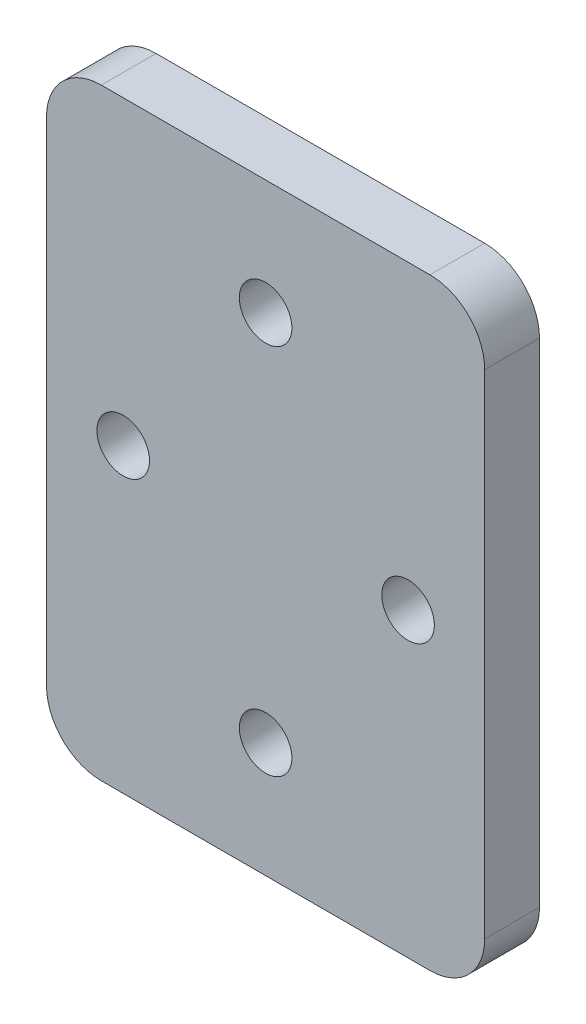
ISO-10303-21;
HEADER;
FILE_DESCRIPTION(('STEP AP214'),'2;1');
FILE_NAME('part.step','',(''),(''),'','','');
FILE_SCHEMA(('AUTOMOTIVE_DESIGN { 1 0 10303 214 1 1 1 1 }'));
ENDSEC;
DATA;
#1=APPLICATION_CONTEXT('core data for automotive mechanical design processes');
#2=APPLICATION_PROTOCOL_DEFINITION('international standard','automotive_design',2000,#1);
#3=PRODUCT_CONTEXT('',#1,'mechanical');
#4=PRODUCT('Part','Part','',(#3));
#5=PRODUCT_RELATED_PRODUCT_CATEGORY('part','',(#4));
#6=PRODUCT_DEFINITION_FORMATION('','',#4);
#7=PRODUCT_DEFINITION_CONTEXT('part definition',#1,'design');
#8=PRODUCT_DEFINITION('design','',#6,#7);
#9=PRODUCT_DEFINITION_SHAPE('','',#8);
#10=(LENGTH_UNIT() NAMED_UNIT(*) SI_UNIT(.MILLI.,.METRE.));
#11=(NAMED_UNIT(*) PLANE_ANGLE_UNIT() SI_UNIT($,.RADIAN.));
#12=(NAMED_UNIT(*) SI_UNIT($,.STERADIAN.) SOLID_ANGLE_UNIT());
#13=UNCERTAINTY_MEASURE_WITH_UNIT(LENGTH_MEASURE(1.E-05),#10,'distance_accuracy_value','');
#14=(GEOMETRIC_REPRESENTATION_CONTEXT(3) GLOBAL_UNCERTAINTY_ASSIGNED_CONTEXT((#13)) GLOBAL_UNIT_ASSIGNED_CONTEXT((#10,
#11,#12)) REPRESENTATION_CONTEXT('',''));
#15=CARTESIAN_POINT('',(0.,0.,0.));
#16=DIRECTION('',(0.,0.,1.));
#17=DIRECTION('',(1.,0.,0.));
#18=AXIS2_PLACEMENT_3D('',#15,#16,#17);
#19=CARTESIAN_POINT('',(0.,0.,5.));
#20=DIRECTION('',(0.,0.,1.));
#21=DIRECTION('',(1.,0.,0.));
#22=AXIS2_PLACEMENT_3D('',#19,#20,#21);
#23=PLANE('',#22);
#24=CARTESIAN_POINT('',(0.,-17.,5.));
#25=DIRECTION('',(0.,0.,1.));
#26=DIRECTION('',(-1.,0.,0.));
#27=AXIS2_PLACEMENT_3D('',#24,#25,#26);
#28=CIRCLE('',#27,2.4);
#29=CARTESIAN_POINT('',(-2.4,-17.,5.));
#30=VERTEX_POINT('',#29);
#31=EDGE_CURVE('E186',#30,#30,#28,.T.);
#32=ORIENTED_EDGE('',*,*,#31,.F.);
#33=EDGE_LOOP('',(#32));
#34=FACE_BOUND('',#33,.T.);
#35=CARTESIAN_POINT('',(0.,17.,5.));
#36=DIRECTION('',(0.,0.,1.));
#37=DIRECTION('',(1.,0.,0.));
#38=AXIS2_PLACEMENT_3D('',#35,#36,#37);
#39=CIRCLE('',#38,2.4);
#40=CARTESIAN_POINT('',(2.4,17.,5.));
#41=VERTEX_POINT('',#40);
#42=EDGE_CURVE('E132',#41,#41,#39,.T.);
#43=ORIENTED_EDGE('',*,*,#42,.F.);
#44=EDGE_LOOP('',(#43));
#45=FACE_BOUND('',#44,.T.);
#46=DIRECTION('',(0.,1.,0.));
#47=VECTOR('',#46,1.);
#48=CARTESIAN_POINT('',(20.,27.5,5.));
#49=LINE('',#48,#47);
#50=CARTESIAN_POINT('',(20.,-22.5,5.));
#51=VERTEX_POINT('',#50);
#52=CARTESIAN_POINT('',(20.,22.5,5.));
#53=VERTEX_POINT('',#52);
#54=EDGE_CURVE('E137',#51,#53,#49,.T.);
#55=ORIENTED_EDGE('',*,*,#54,.T.);
#56=CARTESIAN_POINT('',(15.,22.5,5.));
#57=DIRECTION('',(0.,0.,1.));
#58=DIRECTION('',(1.,0.,0.));
#59=AXIS2_PLACEMENT_3D('',#56,#57,#58);
#60=CIRCLE('',#59,5.);
#61=CARTESIAN_POINT('',(15.,27.5,5.));
#62=VERTEX_POINT('',#61);
#63=EDGE_CURVE('E152',#53,#62,#60,.T.);
#64=ORIENTED_EDGE('',*,*,#63,.T.);
#65=DIRECTION('',(-1.,0.,0.));
#66=VECTOR('',#65,1.);
#67=CARTESIAN_POINT('',(-20.,27.5,5.));
#68=LINE('',#67,#66);
#69=CARTESIAN_POINT('',(-15.,27.5,5.));
#70=VERTEX_POINT('',#69);
#71=EDGE_CURVE('E119',#62,#70,#68,.T.);
#72=ORIENTED_EDGE('',*,*,#71,.T.);
#73=CARTESIAN_POINT('',(-15.,22.5,5.));
#74=DIRECTION('',(0.,0.,1.));
#75=DIRECTION('',(1.,0.,0.));
#76=AXIS2_PLACEMENT_3D('',#73,#74,#75);
#77=CIRCLE('',#76,5.);
#78=CARTESIAN_POINT('',(-20.,22.5,5.));
#79=VERTEX_POINT('',#78);
#80=EDGE_CURVE('E147',#70,#79,#77,.T.);
#81=ORIENTED_EDGE('',*,*,#80,.T.);
#82=DIRECTION('',(0.,-1.,0.));
#83=VECTOR('',#82,1.);
#84=CARTESIAN_POINT('',(-20.,27.5,5.));
#85=LINE('',#84,#83);
#86=CARTESIAN_POINT('',(-20.,-22.5,5.));
#87=VERTEX_POINT('',#86);
#88=EDGE_CURVE('E163',#79,#87,#85,.T.);
#89=ORIENTED_EDGE('',*,*,#88,.T.);
#90=CARTESIAN_POINT('',(-15.,-22.5,5.));
#91=DIRECTION('',(0.,0.,1.));
#92=DIRECTION('',(1.,0.,0.));
#93=AXIS2_PLACEMENT_3D('',#90,#91,#92);
#94=CIRCLE('',#93,5.);
#95=CARTESIAN_POINT('',(-15.,-27.5,5.));
#96=VERTEX_POINT('',#95);
#97=EDGE_CURVE('E55',#87,#96,#94,.T.);
#98=ORIENTED_EDGE('',*,*,#97,.T.);
#99=DIRECTION('',(1.,0.,0.));
#100=VECTOR('',#99,1.);
#101=CARTESIAN_POINT('',(-20.,-27.5,5.));
#102=LINE('',#101,#100);
#103=CARTESIAN_POINT('',(15.,-27.5,5.));
#104=VERTEX_POINT('',#103);
#105=EDGE_CURVE('E138',#96,#104,#102,.T.);
#106=ORIENTED_EDGE('',*,*,#105,.T.);
#107=CARTESIAN_POINT('',(15.,-22.5,5.));
#108=DIRECTION('',(0.,0.,1.));
#109=DIRECTION('',(1.,0.,0.));
#110=AXIS2_PLACEMENT_3D('',#107,#108,#109);
#111=CIRCLE('',#110,5.);
#112=EDGE_CURVE('E150',#104,#51,#111,.T.);
#113=ORIENTED_EDGE('',*,*,#112,.T.);
#114=EDGE_LOOP('',(#55,#64,#72,#81,#89,#98,#106,#113));
#115=FACE_BOUND('',#114,.T.);
#116=CARTESIAN_POINT('',(-13.,0.,5.));
#117=DIRECTION('',(0.,0.,1.));
#118=DIRECTION('',(1.,0.,0.));
#119=AXIS2_PLACEMENT_3D('',#116,#117,#118);
#120=CIRCLE('',#119,2.4);
#121=CARTESIAN_POINT('',(-10.6,0.,5.));
#122=VERTEX_POINT('',#121);
#123=EDGE_CURVE('E180',#122,#122,#120,.T.);
#124=ORIENTED_EDGE('',*,*,#123,.F.);
#125=EDGE_LOOP('',(#124));
#126=FACE_BOUND('',#125,.T.);
#127=CARTESIAN_POINT('',(13.,0.,5.));
#128=DIRECTION('',(0.,0.,1.));
#129=DIRECTION('',(-1.,0.,0.));
#130=AXIS2_PLACEMENT_3D('',#127,#128,#129);
#131=CIRCLE('',#130,2.4);
#132=CARTESIAN_POINT('',(10.6,0.,5.));
#133=VERTEX_POINT('',#132);
#134=EDGE_CURVE('E192',#133,#133,#131,.T.);
#135=ORIENTED_EDGE('',*,*,#134,.F.);
#136=EDGE_LOOP('',(#135));
#137=FACE_BOUND('',#136,.T.);
#138=ADVANCED_FACE('F33',(#34,#45,#115,#126,#137),#23,.T.);
#139=CARTESIAN_POINT('',(0.,0.,0.));
#140=DIRECTION('',(0.,0.,1.));
#141=DIRECTION('',(1.,0.,0.));
#142=AXIS2_PLACEMENT_3D('',#139,#140,#141);
#143=PLANE('',#142);
#144=DIRECTION('',(-1.,0.,0.));
#145=VECTOR('',#144,1.);
#146=CARTESIAN_POINT('',(-20.,27.5,0.));
#147=LINE('',#146,#145);
#148=CARTESIAN_POINT('',(15.,27.5,0.));
#149=VERTEX_POINT('',#148);
#150=CARTESIAN_POINT('',(-15.,27.5,0.));
#151=VERTEX_POINT('',#150);
#152=EDGE_CURVE('E116',#149,#151,#147,.T.);
#153=ORIENTED_EDGE('',*,*,#152,.F.);
#154=CARTESIAN_POINT('',(15.,22.5,0.));
#155=DIRECTION('',(0.,0.,1.));
#156=DIRECTION('',(1.,0.,0.));
#157=AXIS2_PLACEMENT_3D('',#154,#155,#156);
#158=CIRCLE('',#157,5.);
#159=CARTESIAN_POINT('',(20.,22.5,0.));
#160=VERTEX_POINT('',#159);
#161=EDGE_CURVE('E99',#149,#160,#158,.F.);
#162=ORIENTED_EDGE('',*,*,#161,.T.);
#163=DIRECTION('',(0.,1.,0.));
#164=VECTOR('',#163,1.);
#165=CARTESIAN_POINT('',(20.,27.5,0.));
#166=LINE('',#165,#164);
#167=CARTESIAN_POINT('',(20.,-22.5,0.));
#168=VERTEX_POINT('',#167);
#169=EDGE_CURVE('E127',#168,#160,#166,.T.);
#170=ORIENTED_EDGE('',*,*,#169,.F.);
#171=CARTESIAN_POINT('',(15.,-22.5,0.));
#172=DIRECTION('',(0.,0.,1.));
#173=DIRECTION('',(1.,0.,0.));
#174=AXIS2_PLACEMENT_3D('',#171,#172,#173);
#175=CIRCLE('',#174,5.);
#176=CARTESIAN_POINT('',(15.,-27.5,0.));
#177=VERTEX_POINT('',#176);
#178=EDGE_CURVE('E110',#168,#177,#175,.F.);
#179=ORIENTED_EDGE('',*,*,#178,.T.);
#180=DIRECTION('',(1.,0.,0.));
#181=VECTOR('',#180,1.);
#182=CARTESIAN_POINT('',(-20.,-27.5,0.));
#183=LINE('',#182,#181);
#184=CARTESIAN_POINT('',(-15.,-27.5,0.));
#185=VERTEX_POINT('',#184);
#186=EDGE_CURVE('E130',#185,#177,#183,.T.);
#187=ORIENTED_EDGE('',*,*,#186,.F.);
#188=CARTESIAN_POINT('',(-15.,-22.5,0.));
#189=DIRECTION('',(0.,0.,1.));
#190=DIRECTION('',(1.,0.,0.));
#191=AXIS2_PLACEMENT_3D('',#188,#189,#190);
#192=CIRCLE('',#191,5.);
#193=CARTESIAN_POINT('',(-20.,-22.5,0.));
#194=VERTEX_POINT('',#193);
#195=EDGE_CURVE('E141',#185,#194,#192,.F.);
#196=ORIENTED_EDGE('',*,*,#195,.T.);
#197=DIRECTION('',(0.,-1.,0.));
#198=VECTOR('',#197,1.);
#199=CARTESIAN_POINT('',(-20.,27.5,0.));
#200=LINE('',#199,#198);
#201=CARTESIAN_POINT('',(-20.,22.5,0.));
#202=VERTEX_POINT('',#201);
#203=EDGE_CURVE('E126',#202,#194,#200,.T.);
#204=ORIENTED_EDGE('',*,*,#203,.F.);
#205=CARTESIAN_POINT('',(-15.,22.5,0.));
#206=DIRECTION('',(0.,0.,1.));
#207=DIRECTION('',(1.,0.,0.));
#208=AXIS2_PLACEMENT_3D('',#205,#206,#207);
#209=CIRCLE('',#208,5.);
#210=EDGE_CURVE('E120',#202,#151,#209,.F.);
#211=ORIENTED_EDGE('',*,*,#210,.T.);
#212=EDGE_LOOP('',(#153,#162,#170,#179,#187,#196,#204,#211));
#213=FACE_BOUND('',#212,.T.);
#214=CARTESIAN_POINT('',(0.,17.,0.));
#215=DIRECTION('',(0.,0.,1.));
#216=DIRECTION('',(1.,0.,0.));
#217=AXIS2_PLACEMENT_3D('',#214,#215,#216);
#218=CIRCLE('',#217,2.4);
#219=CARTESIAN_POINT('',(2.4,17.,0.));
#220=VERTEX_POINT('',#219);
#221=EDGE_CURVE('E177',#220,#220,#218,.T.);
#222=ORIENTED_EDGE('',*,*,#221,.T.);
#223=EDGE_LOOP('',(#222));
#224=FACE_BOUND('',#223,.T.);
#225=CARTESIAN_POINT('',(-13.,0.,0.));
#226=DIRECTION('',(0.,0.,1.));
#227=DIRECTION('',(1.,0.,0.));
#228=AXIS2_PLACEMENT_3D('',#225,#226,#227);
#229=CIRCLE('',#228,2.4);
#230=CARTESIAN_POINT('',(-10.6,0.,0.));
#231=VERTEX_POINT('',#230);
#232=EDGE_CURVE('E183',#231,#231,#229,.T.);
#233=ORIENTED_EDGE('',*,*,#232,.T.);
#234=EDGE_LOOP('',(#233));
#235=FACE_BOUND('',#234,.T.);
#236=CARTESIAN_POINT('',(0.,-17.,0.));
#237=DIRECTION('',(0.,0.,1.));
#238=DIRECTION('',(-1.,0.,0.));
#239=AXIS2_PLACEMENT_3D('',#236,#237,#238);
#240=CIRCLE('',#239,2.4);
#241=CARTESIAN_POINT('',(-2.4,-17.,0.));
#242=VERTEX_POINT('',#241);
#243=EDGE_CURVE('E189',#242,#242,#240,.T.);
#244=ORIENTED_EDGE('',*,*,#243,.T.);
#245=EDGE_LOOP('',(#244));
#246=FACE_BOUND('',#245,.T.);
#247=CARTESIAN_POINT('',(13.,0.,0.));
#248=DIRECTION('',(0.,0.,1.));
#249=DIRECTION('',(-1.,0.,0.));
#250=AXIS2_PLACEMENT_3D('',#247,#248,#249);
#251=CIRCLE('',#250,2.4);
#252=CARTESIAN_POINT('',(10.6,0.,0.));
#253=VERTEX_POINT('',#252);
#254=EDGE_CURVE('E195',#253,#253,#251,.T.);
#255=ORIENTED_EDGE('',*,*,#254,.T.);
#256=EDGE_LOOP('',(#255));
#257=FACE_BOUND('',#256,.T.);
#258=ADVANCED_FACE('F123',(#213,#224,#235,#246,#257),#143,.F.);
#259=CARTESIAN_POINT('',(20.,27.5,5.));
#260=DIRECTION('',(-1.,0.,0.));
#261=DIRECTION('',(0.,0.,1.));
#262=AXIS2_PLACEMENT_3D('',#259,#260,#261);
#263=PLANE('',#262);
#264=ORIENTED_EDGE('',*,*,#169,.T.);
#265=DIRECTION('',(0.,0.,-1.));
#266=VECTOR('',#265,1.);
#267=CARTESIAN_POINT('',(20.,22.5,5.));
#268=LINE('',#267,#266);
#269=EDGE_CURVE('E104',#160,#53,#268,.F.);
#270=ORIENTED_EDGE('',*,*,#269,.T.);
#271=ORIENTED_EDGE('',*,*,#54,.F.);
#272=DIRECTION('',(0.,0.,-1.));
#273=VECTOR('',#272,1.);
#274=CARTESIAN_POINT('',(20.,-22.5,5.));
#275=LINE('',#274,#273);
#276=EDGE_CURVE('E109',#51,#168,#275,.T.);
#277=ORIENTED_EDGE('',*,*,#276,.T.);
#278=EDGE_LOOP('',(#264,#270,#271,#277));
#279=FACE_BOUND('',#278,.T.);
#280=ADVANCED_FACE('F210',(#279),#263,.F.);
#281=CARTESIAN_POINT('',(-20.,27.5,5.));
#282=DIRECTION('',(0.,-1.,0.));
#283=DIRECTION('',(0.,0.,-1.));
#284=AXIS2_PLACEMENT_3D('',#281,#282,#283);
#285=PLANE('',#284);
#286=ORIENTED_EDGE('',*,*,#71,.F.);
#287=DIRECTION('',(0.,0.,-1.));
#288=VECTOR('',#287,1.);
#289=CARTESIAN_POINT('',(15.,27.5,5.));
#290=LINE('',#289,#288);
#291=EDGE_CURVE('E103',#62,#149,#290,.T.);
#292=ORIENTED_EDGE('',*,*,#291,.T.);
#293=ORIENTED_EDGE('',*,*,#152,.T.);
#294=DIRECTION('',(0.,0.,-1.));
#295=VECTOR('',#294,1.);
#296=CARTESIAN_POINT('',(-15.,27.5,5.));
#297=LINE('',#296,#295);
#298=EDGE_CURVE('E121',#151,#70,#297,.F.);
#299=ORIENTED_EDGE('',*,*,#298,.T.);
#300=EDGE_LOOP('',(#286,#292,#293,#299));
#301=FACE_BOUND('',#300,.T.);
#302=ADVANCED_FACE('F115',(#301),#285,.F.);
#303=CARTESIAN_POINT('',(-20.,27.5,5.));
#304=DIRECTION('',(1.,0.,0.));
#305=DIRECTION('',(0.,0.,-1.));
#306=AXIS2_PLACEMENT_3D('',#303,#304,#305);
#307=PLANE('',#306);
#308=ORIENTED_EDGE('',*,*,#203,.T.);
#309=DIRECTION('',(0.,0.,-1.));
#310=VECTOR('',#309,1.);
#311=CARTESIAN_POINT('',(-20.,-22.5,5.));
#312=LINE('',#311,#310);
#313=EDGE_CURVE('E11',#194,#87,#312,.F.);
#314=ORIENTED_EDGE('',*,*,#313,.T.);
#315=ORIENTED_EDGE('',*,*,#88,.F.);
#316=DIRECTION('',(0.,0.,-1.));
#317=VECTOR('',#316,1.);
#318=CARTESIAN_POINT('',(-20.,22.5,5.));
#319=LINE('',#318,#317);
#320=EDGE_CURVE('E41',#79,#202,#319,.T.);
#321=ORIENTED_EDGE('',*,*,#320,.T.);
#322=EDGE_LOOP('',(#308,#314,#315,#321));
#323=FACE_BOUND('',#322,.T.);
#324=ADVANCED_FACE('F161',(#323),#307,.F.);
#325=CARTESIAN_POINT('',(-20.,-27.5,5.));
#326=DIRECTION('',(0.,1.,0.));
#327=DIRECTION('',(0.,0.,1.));
#328=AXIS2_PLACEMENT_3D('',#325,#326,#327);
#329=PLANE('',#328);
#330=ORIENTED_EDGE('',*,*,#186,.T.);
#331=DIRECTION('',(0.,0.,-1.));
#332=VECTOR('',#331,1.);
#333=CARTESIAN_POINT('',(15.,-27.5,5.));
#334=LINE('',#333,#332);
#335=EDGE_CURVE('E48',#177,#104,#334,.F.);
#336=ORIENTED_EDGE('',*,*,#335,.T.);
#337=ORIENTED_EDGE('',*,*,#105,.F.);
#338=DIRECTION('',(0.,0.,-1.));
#339=VECTOR('',#338,1.);
#340=CARTESIAN_POINT('',(-15.,-27.5,5.));
#341=LINE('',#340,#339);
#342=EDGE_CURVE('E154',#96,#185,#341,.T.);
#343=ORIENTED_EDGE('',*,*,#342,.T.);
#344=EDGE_LOOP('',(#330,#336,#337,#343));
#345=FACE_BOUND('',#344,.T.);
#346=ADVANCED_FACE('F170',(#345),#329,.F.);
#347=CARTESIAN_POINT('',(0.,17.,5.));
#348=DIRECTION('',(0.,0.,-1.));
#349=DIRECTION('',(-1.,0.,0.));
#350=AXIS2_PLACEMENT_3D('',#347,#348,#349);
#351=CYLINDRICAL_SURFACE('',#350,2.4);
#352=ORIENTED_EDGE('',*,*,#42,.T.);
#353=EDGE_LOOP('',(#352));
#354=FACE_BOUND('',#353,.T.);
#355=ORIENTED_EDGE('',*,*,#221,.F.);
#356=EDGE_LOOP('',(#355));
#357=FACE_BOUND('',#356,.T.);
#358=ADVANCED_FACE('F215',(#354,#357),#351,.F.);
#359=CARTESIAN_POINT('',(-13.,0.,5.));
#360=DIRECTION('',(0.,0.,-1.));
#361=DIRECTION('',(-1.,0.,0.));
#362=AXIS2_PLACEMENT_3D('',#359,#360,#361);
#363=CYLINDRICAL_SURFACE('',#362,2.4);
#364=ORIENTED_EDGE('',*,*,#123,.T.);
#365=EDGE_LOOP('',(#364));
#366=FACE_BOUND('',#365,.T.);
#367=ORIENTED_EDGE('',*,*,#232,.F.);
#368=EDGE_LOOP('',(#367));
#369=FACE_BOUND('',#368,.T.);
#370=ADVANCED_FACE('F243',(#366,#369),#363,.F.);
#371=CARTESIAN_POINT('',(0.,-17.,5.));
#372=DIRECTION('',(0.,0.,-1.));
#373=DIRECTION('',(-1.,0.,0.));
#374=AXIS2_PLACEMENT_3D('',#371,#372,#373);
#375=CYLINDRICAL_SURFACE('',#374,2.4);
#376=ORIENTED_EDGE('',*,*,#31,.T.);
#377=EDGE_LOOP('',(#376));
#378=FACE_BOUND('',#377,.T.);
#379=ORIENTED_EDGE('',*,*,#243,.F.);
#380=EDGE_LOOP('',(#379));
#381=FACE_BOUND('',#380,.T.);
#382=ADVANCED_FACE('F246',(#378,#381),#375,.F.);
#383=CARTESIAN_POINT('',(13.,0.,5.));
#384=DIRECTION('',(0.,0.,-1.));
#385=DIRECTION('',(-1.,0.,0.));
#386=AXIS2_PLACEMENT_3D('',#383,#384,#385);
#387=CYLINDRICAL_SURFACE('',#386,2.4);
#388=ORIENTED_EDGE('',*,*,#134,.T.);
#389=EDGE_LOOP('',(#388));
#390=FACE_BOUND('',#389,.T.);
#391=ORIENTED_EDGE('',*,*,#254,.F.);
#392=EDGE_LOOP('',(#391));
#393=FACE_BOUND('',#392,.T.);
#394=ADVANCED_FACE('F201',(#390,#393),#387,.F.);
#395=CARTESIAN_POINT('',(15.,22.5,5.));
#396=DIRECTION('',(0.,0.,-1.));
#397=DIRECTION('',(-1.,0.,0.));
#398=AXIS2_PLACEMENT_3D('',#395,#396,#397);
#399=CYLINDRICAL_SURFACE('',#398,5.);
#400=ORIENTED_EDGE('',*,*,#63,.F.);
#401=ORIENTED_EDGE('',*,*,#269,.F.);
#402=ORIENTED_EDGE('',*,*,#161,.F.);
#403=ORIENTED_EDGE('',*,*,#291,.F.);
#404=EDGE_LOOP('',(#400,#401,#402,#403));
#405=FACE_BOUND('',#404,.T.);
#406=ADVANCED_FACE('F102',(#405),#399,.T.);
#407=CARTESIAN_POINT('',(15.,-22.5,5.));
#408=DIRECTION('',(0.,0.,-1.));
#409=DIRECTION('',(-1.,0.,0.));
#410=AXIS2_PLACEMENT_3D('',#407,#408,#409);
#411=CYLINDRICAL_SURFACE('',#410,5.);
#412=ORIENTED_EDGE('',*,*,#112,.F.);
#413=ORIENTED_EDGE('',*,*,#335,.F.);
#414=ORIENTED_EDGE('',*,*,#178,.F.);
#415=ORIENTED_EDGE('',*,*,#276,.F.);
#416=EDGE_LOOP('',(#412,#413,#414,#415));
#417=FACE_BOUND('',#416,.T.);
#418=ADVANCED_FACE('F229',(#417),#411,.T.);
#419=CARTESIAN_POINT('',(-15.,-22.5,5.));
#420=DIRECTION('',(0.,0.,-1.));
#421=DIRECTION('',(-1.,0.,0.));
#422=AXIS2_PLACEMENT_3D('',#419,#420,#421);
#423=CYLINDRICAL_SURFACE('',#422,5.);
#424=ORIENTED_EDGE('',*,*,#97,.F.);
#425=ORIENTED_EDGE('',*,*,#313,.F.);
#426=ORIENTED_EDGE('',*,*,#195,.F.);
#427=ORIENTED_EDGE('',*,*,#342,.F.);
#428=EDGE_LOOP('',(#424,#425,#426,#427));
#429=FACE_BOUND('',#428,.T.);
#430=ADVANCED_FACE('F169',(#429),#423,.T.);
#431=CARTESIAN_POINT('',(-15.,22.5,5.));
#432=DIRECTION('',(0.,0.,-1.));
#433=DIRECTION('',(-1.,0.,0.));
#434=AXIS2_PLACEMENT_3D('',#431,#432,#433);
#435=CYLINDRICAL_SURFACE('',#434,5.);
#436=ORIENTED_EDGE('',*,*,#80,.F.);
#437=ORIENTED_EDGE('',*,*,#298,.F.);
#438=ORIENTED_EDGE('',*,*,#210,.F.);
#439=ORIENTED_EDGE('',*,*,#320,.F.);
#440=EDGE_LOOP('',(#436,#437,#438,#439));
#441=FACE_BOUND('',#440,.T.);
#442=ADVANCED_FACE('F35',(#441),#435,.T.);
#443=CLOSED_SHELL('',(#138,#258,#280,#302,#324,#346,#358,#370,#382,#394,#406,#418,#430,#442));
#444=MANIFOLD_SOLID_BREP('B2',#443);
#445=ADVANCED_BREP_SHAPE_REPRESENTATION('',(#18,#444),#14);
#446=SHAPE_DEFINITION_REPRESENTATION(#9,#445);
ENDSEC;
END-ISO-10303-21;
